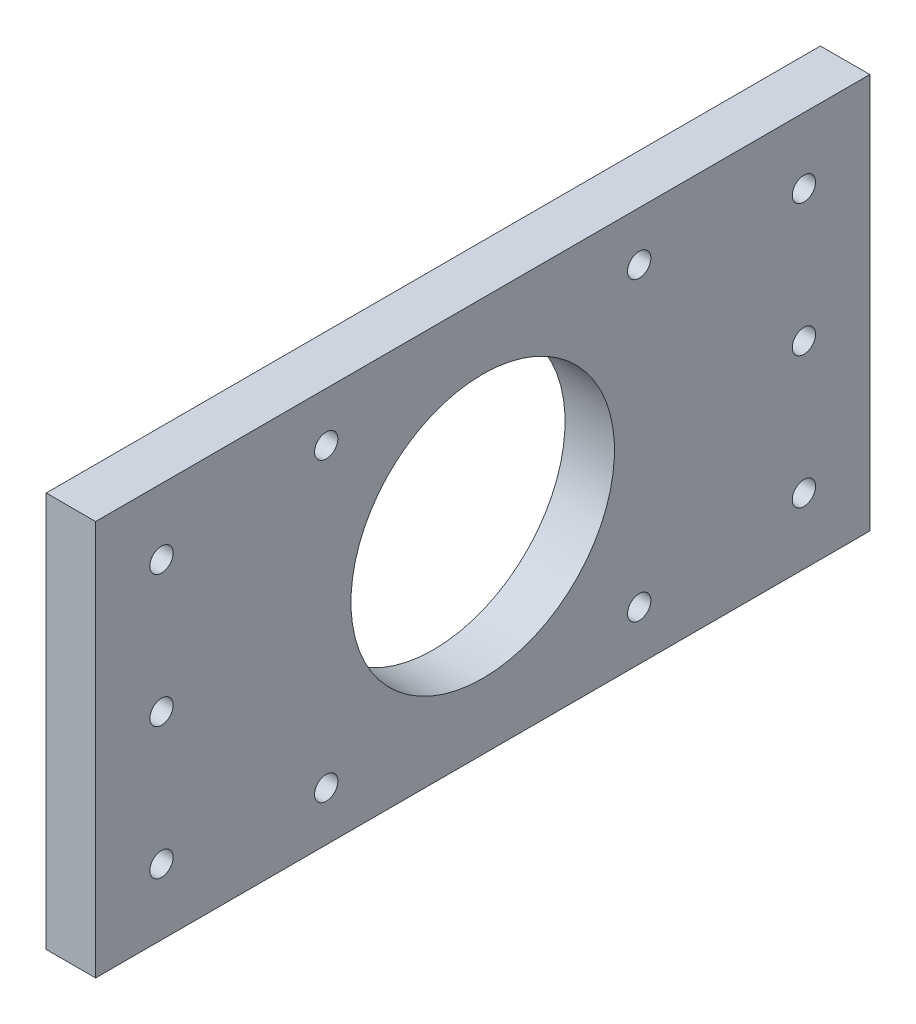
ISO-10303-21;
HEADER;
FILE_DESCRIPTION(('STEP AP214'),'2;1');
FILE_NAME('part.step','',(''),(''),'','','');
FILE_SCHEMA(('AUTOMOTIVE_DESIGN { 1 0 10303 214 1 1 1 1 }'));
ENDSEC;
DATA;
#1=APPLICATION_CONTEXT('core data for automotive mechanical design processes');
#2=APPLICATION_PROTOCOL_DEFINITION('international standard','automotive_design',2000,#1);
#3=PRODUCT_CONTEXT('',#1,'mechanical');
#4=PRODUCT('Part','Part','',(#3));
#5=PRODUCT_RELATED_PRODUCT_CATEGORY('part','',(#4));
#6=PRODUCT_DEFINITION_FORMATION('','',#4);
#7=PRODUCT_DEFINITION_CONTEXT('part definition',#1,'design');
#8=PRODUCT_DEFINITION('design','',#6,#7);
#9=PRODUCT_DEFINITION_SHAPE('','',#8);
#10=(LENGTH_UNIT() NAMED_UNIT(*) SI_UNIT(.MILLI.,.METRE.));
#11=(NAMED_UNIT(*) PLANE_ANGLE_UNIT() SI_UNIT($,.RADIAN.));
#12=(NAMED_UNIT(*) SI_UNIT($,.STERADIAN.) SOLID_ANGLE_UNIT());
#13=UNCERTAINTY_MEASURE_WITH_UNIT(LENGTH_MEASURE(1.E-05),#10,'distance_accuracy_value','');
#14=(GEOMETRIC_REPRESENTATION_CONTEXT(3) GLOBAL_UNCERTAINTY_ASSIGNED_CONTEXT((#13)) GLOBAL_UNIT_ASSIGNED_CONTEXT((#10,
#11,#12)) REPRESENTATION_CONTEXT('',''));
#15=CARTESIAN_POINT('',(0.,0.,0.));
#16=DIRECTION('',(0.,0.,1.));
#17=DIRECTION('',(1.,0.,0.));
#18=AXIS2_PLACEMENT_3D('',#15,#16,#17);
#19=CARTESIAN_POINT('',(4.76249999999999,38.1,149.225));
#20=DIRECTION('',(-1.,0.,0.));
#21=DIRECTION('',(0.,-1.,0.));
#22=AXIS2_PLACEMENT_3D('',#19,#20,#21);
#23=PLANE('',#22);
#24=CARTESIAN_POINT('',(4.7625,0.,74.6125));
#25=DIRECTION('',(1.,0.,0.));
#26=DIRECTION('',(0.,1.,0.));
#27=AXIS2_PLACEMENT_3D('',#24,#25,#26);
#28=CIRCLE('',#27,25.4);
#29=CARTESIAN_POINT('',(4.7625,25.4,74.6125));
#30=VERTEX_POINT('',#29);
#31=EDGE_CURVE('E170',#30,#30,#28,.T.);
#32=ORIENTED_EDGE('',*,*,#31,.F.);
#33=EDGE_LOOP('',(#32));
#34=FACE_BOUND('',#33,.T.);
#35=CARTESIAN_POINT('',(4.7625,25.4,136.525));
#36=DIRECTION('',(1.,0.,0.));
#37=DIRECTION('',(0.,0.,-1.));
#38=AXIS2_PLACEMENT_3D('',#35,#36,#37);
#39=CIRCLE('',#38,2.24789999999999);
#40=CARTESIAN_POINT('',(4.7625,25.4,134.2771));
#41=VERTEX_POINT('',#40);
#42=EDGE_CURVE('E166',#41,#41,#39,.T.);
#43=ORIENTED_EDGE('',*,*,#42,.F.);
#44=EDGE_LOOP('',(#43));
#45=FACE_BOUND('',#44,.T.);
#46=CARTESIAN_POINT('',(4.7625,0.,136.525));
#47=DIRECTION('',(1.,0.,0.));
#48=DIRECTION('',(0.,0.,-1.));
#49=AXIS2_PLACEMENT_3D('',#46,#47,#48);
#50=CIRCLE('',#49,2.24789999999999);
#51=CARTESIAN_POINT('',(4.7625,0.,134.2771));
#52=VERTEX_POINT('',#51);
#53=EDGE_CURVE('E160',#52,#52,#50,.T.);
#54=ORIENTED_EDGE('',*,*,#53,.F.);
#55=EDGE_LOOP('',(#54));
#56=FACE_BOUND('',#55,.T.);
#57=CARTESIAN_POINT('',(4.7625,-25.4,136.525));
#58=DIRECTION('',(1.,0.,0.));
#59=DIRECTION('',(0.,0.,-1.));
#60=AXIS2_PLACEMENT_3D('',#57,#58,#59);
#61=CIRCLE('',#60,2.24789999999999);
#62=CARTESIAN_POINT('',(4.7625,-25.4,134.2771));
#63=VERTEX_POINT('',#62);
#64=EDGE_CURVE('E154',#63,#63,#61,.T.);
#65=ORIENTED_EDGE('',*,*,#64,.F.);
#66=EDGE_LOOP('',(#65));
#67=FACE_BOUND('',#66,.T.);
#68=CARTESIAN_POINT('',(4.7625,25.4,12.7));
#69=DIRECTION('',(1.,0.,0.));
#70=DIRECTION('',(0.,0.,-1.));
#71=AXIS2_PLACEMENT_3D('',#68,#69,#70);
#72=CIRCLE('',#71,2.24789999999999);
#73=CARTESIAN_POINT('',(4.7625,25.4,10.4521));
#74=VERTEX_POINT('',#73);
#75=EDGE_CURVE('E148',#74,#74,#72,.T.);
#76=ORIENTED_EDGE('',*,*,#75,.F.);
#77=EDGE_LOOP('',(#76));
#78=FACE_BOUND('',#77,.T.);
#79=CARTESIAN_POINT('',(4.7625,0.,12.7));
#80=DIRECTION('',(1.,0.,0.));
#81=DIRECTION('',(0.,0.,-1.));
#82=AXIS2_PLACEMENT_3D('',#79,#80,#81);
#83=CIRCLE('',#82,2.24789999999999);
#84=CARTESIAN_POINT('',(4.7625,0.,10.4521));
#85=VERTEX_POINT('',#84);
#86=EDGE_CURVE('E142',#85,#85,#83,.T.);
#87=ORIENTED_EDGE('',*,*,#86,.F.);
#88=EDGE_LOOP('',(#87));
#89=FACE_BOUND('',#88,.T.);
#90=CARTESIAN_POINT('',(4.7625,-25.4,12.7));
#91=DIRECTION('',(1.,0.,0.));
#92=DIRECTION('',(0.,0.,-1.));
#93=AXIS2_PLACEMENT_3D('',#90,#91,#92);
#94=CIRCLE('',#93,2.24789999999999);
#95=CARTESIAN_POINT('',(4.7625,-25.4,10.4521));
#96=VERTEX_POINT('',#95);
#97=EDGE_CURVE('E136',#96,#96,#94,.T.);
#98=ORIENTED_EDGE('',*,*,#97,.F.);
#99=EDGE_LOOP('',(#98));
#100=FACE_BOUND('',#99,.T.);
#101=CARTESIAN_POINT('',(4.7625,-28.575,44.45));
#102=DIRECTION('',(1.,0.,0.));
#103=DIRECTION('',(0.,0.,-1.));
#104=AXIS2_PLACEMENT_3D('',#101,#102,#103);
#105=CIRCLE('',#104,2.24789999999999);
#106=CARTESIAN_POINT('',(4.7625,-28.575,42.2021));
#107=VERTEX_POINT('',#106);
#108=EDGE_CURVE('E130',#107,#107,#105,.T.);
#109=ORIENTED_EDGE('',*,*,#108,.F.);
#110=EDGE_LOOP('',(#109));
#111=FACE_BOUND('',#110,.T.);
#112=CARTESIAN_POINT('',(4.7625,28.575,104.775));
#113=DIRECTION('',(1.,0.,0.));
#114=DIRECTION('',(0.,0.,-1.));
#115=AXIS2_PLACEMENT_3D('',#112,#113,#114);
#116=CIRCLE('',#115,2.24789999999999);
#117=CARTESIAN_POINT('',(4.7625,28.575,102.5271));
#118=VERTEX_POINT('',#117);
#119=EDGE_CURVE('E124',#118,#118,#116,.T.);
#120=ORIENTED_EDGE('',*,*,#119,.F.);
#121=EDGE_LOOP('',(#120));
#122=FACE_BOUND('',#121,.T.);
#123=CARTESIAN_POINT('',(4.7625,-28.575,104.775));
#124=DIRECTION('',(1.,0.,0.));
#125=DIRECTION('',(0.,0.,-1.));
#126=AXIS2_PLACEMENT_3D('',#123,#124,#125);
#127=CIRCLE('',#126,2.24789999999999);
#128=CARTESIAN_POINT('',(4.7625,-28.575,102.5271));
#129=VERTEX_POINT('',#128);
#130=EDGE_CURVE('E118',#129,#129,#127,.T.);
#131=ORIENTED_EDGE('',*,*,#130,.F.);
#132=EDGE_LOOP('',(#131));
#133=FACE_BOUND('',#132,.T.);
#134=CARTESIAN_POINT('',(4.7625,28.575,44.45));
#135=DIRECTION('',(1.,0.,0.));
#136=DIRECTION('',(0.,0.,-1.));
#137=AXIS2_PLACEMENT_3D('',#134,#135,#136);
#138=CIRCLE('',#137,2.24789999999999);
#139=CARTESIAN_POINT('',(4.7625,28.575,42.2021));
#140=VERTEX_POINT('',#139);
#141=EDGE_CURVE('E112',#140,#140,#138,.T.);
#142=ORIENTED_EDGE('',*,*,#141,.F.);
#143=EDGE_LOOP('',(#142));
#144=FACE_BOUND('',#143,.T.);
#145=DIRECTION('',(0.,1.,0.));
#146=VECTOR('',#145,1.);
#147=CARTESIAN_POINT('',(4.76249999999999,38.1,0.));
#148=LINE('',#147,#146);
#149=CARTESIAN_POINT('',(4.7625,-38.1,0.));
#150=VERTEX_POINT('',#149);
#151=CARTESIAN_POINT('',(4.76249999999999,38.1,0.));
#152=VERTEX_POINT('',#151);
#153=EDGE_CURVE('E96',#150,#152,#148,.T.);
#154=ORIENTED_EDGE('',*,*,#153,.T.);
#155=DIRECTION('',(0.,0.,-1.));
#156=VECTOR('',#155,1.);
#157=CARTESIAN_POINT('',(4.76249999999999,38.1,149.225));
#158=LINE('',#157,#156);
#159=CARTESIAN_POINT('',(4.76249999999999,38.1,149.225));
#160=VERTEX_POINT('',#159);
#161=EDGE_CURVE('E11',#160,#152,#158,.T.);
#162=ORIENTED_EDGE('',*,*,#161,.F.);
#163=DIRECTION('',(0.,1.,0.));
#164=VECTOR('',#163,1.);
#165=CARTESIAN_POINT('',(4.76249999999999,38.1,149.225));
#166=LINE('',#165,#164);
#167=CARTESIAN_POINT('',(4.7625,-38.1,149.225));
#168=VERTEX_POINT('',#167);
#169=EDGE_CURVE('E84',#168,#160,#166,.T.);
#170=ORIENTED_EDGE('',*,*,#169,.F.);
#171=DIRECTION('',(0.,0.,-1.));
#172=VECTOR('',#171,1.);
#173=CARTESIAN_POINT('',(4.7625,-38.1,149.225));
#174=LINE('',#173,#172);
#175=EDGE_CURVE('E92',#168,#150,#174,.T.);
#176=ORIENTED_EDGE('',*,*,#175,.T.);
#177=EDGE_LOOP('',(#154,#162,#170,#176));
#178=FACE_BOUND('',#177,.T.);
#179=ADVANCED_FACE('F33',(#34,#45,#56,#67,#78,#89,#100,#111,#122,#133,#144,#178),#23,.F.);
#180=CARTESIAN_POINT('',(-4.76250000000001,38.1,149.225));
#181=DIRECTION('',(0.,-1.,0.));
#182=DIRECTION('',(0.,0.,-1.));
#183=AXIS2_PLACEMENT_3D('',#180,#181,#182);
#184=PLANE('',#183);
#185=DIRECTION('',(-1.,0.,0.));
#186=VECTOR('',#185,1.);
#187=CARTESIAN_POINT('',(-4.76250000000001,38.1,0.));
#188=LINE('',#187,#186);
#189=CARTESIAN_POINT('',(-4.76250000000001,38.1,0.));
#190=VERTEX_POINT('',#189);
#191=EDGE_CURVE('E88',#152,#190,#188,.T.);
#192=ORIENTED_EDGE('',*,*,#191,.T.);
#193=DIRECTION('',(0.,0.,-1.));
#194=VECTOR('',#193,1.);
#195=CARTESIAN_POINT('',(-4.76250000000001,38.1,149.225));
#196=LINE('',#195,#194);
#197=CARTESIAN_POINT('',(-4.76250000000001,38.1,149.225));
#198=VERTEX_POINT('',#197);
#199=EDGE_CURVE('E41',#198,#190,#196,.T.);
#200=ORIENTED_EDGE('',*,*,#199,.F.);
#201=DIRECTION('',(-1.,0.,0.));
#202=VECTOR('',#201,1.);
#203=CARTESIAN_POINT('',(-4.76250000000001,38.1,149.225));
#204=LINE('',#203,#202);
#205=EDGE_CURVE('E79',#160,#198,#204,.T.);
#206=ORIENTED_EDGE('',*,*,#205,.F.);
#207=ORIENTED_EDGE('',*,*,#161,.T.);
#208=EDGE_LOOP('',(#192,#200,#206,#207));
#209=FACE_BOUND('',#208,.T.);
#210=ADVANCED_FACE('F87',(#209),#184,.F.);
#211=CARTESIAN_POINT('',(-4.76250000000001,38.1,149.225));
#212=DIRECTION('',(1.,0.,0.));
#213=DIRECTION('',(0.,1.,0.));
#214=AXIS2_PLACEMENT_3D('',#211,#212,#213);
#215=PLANE('',#214);
#216=CARTESIAN_POINT('',(-4.76250000000003,0.,74.6125));
#217=DIRECTION('',(1.,0.,0.));
#218=DIRECTION('',(0.,1.,0.));
#219=AXIS2_PLACEMENT_3D('',#216,#217,#218);
#220=CIRCLE('',#219,25.4);
#221=CARTESIAN_POINT('',(-4.76250000000003,25.4,74.6125));
#222=VERTEX_POINT('',#221);
#223=EDGE_CURVE('E169',#222,#222,#220,.T.);
#224=ORIENTED_EDGE('',*,*,#223,.T.);
#225=EDGE_LOOP('',(#224));
#226=FACE_BOUND('',#225,.T.);
#227=CARTESIAN_POINT('',(-4.76250000000002,25.4,136.525));
#228=DIRECTION('',(1.,0.,0.));
#229=DIRECTION('',(0.,0.,-1.));
#230=AXIS2_PLACEMENT_3D('',#227,#228,#229);
#231=CIRCLE('',#230,2.2479);
#232=CARTESIAN_POINT('',(-4.76250000000002,25.4,134.2771));
#233=VERTEX_POINT('',#232);
#234=EDGE_CURVE('E163',#233,#233,#231,.T.);
#235=ORIENTED_EDGE('',*,*,#234,.T.);
#236=EDGE_LOOP('',(#235));
#237=FACE_BOUND('',#236,.T.);
#238=CARTESIAN_POINT('',(-4.76250000000002,0.,136.525));
#239=DIRECTION('',(1.,0.,0.));
#240=DIRECTION('',(0.,0.,-1.));
#241=AXIS2_PLACEMENT_3D('',#238,#239,#240);
#242=CIRCLE('',#241,2.2479);
#243=CARTESIAN_POINT('',(-4.76250000000002,0.,134.2771));
#244=VERTEX_POINT('',#243);
#245=EDGE_CURVE('E157',#244,#244,#242,.T.);
#246=ORIENTED_EDGE('',*,*,#245,.T.);
#247=EDGE_LOOP('',(#246));
#248=FACE_BOUND('',#247,.T.);
#249=CARTESIAN_POINT('',(-4.76250000000002,-25.4,136.525));
#250=DIRECTION('',(1.,0.,0.));
#251=DIRECTION('',(0.,0.,-1.));
#252=AXIS2_PLACEMENT_3D('',#249,#250,#251);
#253=CIRCLE('',#252,2.2479);
#254=CARTESIAN_POINT('',(-4.76250000000002,-25.4,134.2771));
#255=VERTEX_POINT('',#254);
#256=EDGE_CURVE('E151',#255,#255,#253,.T.);
#257=ORIENTED_EDGE('',*,*,#256,.T.);
#258=EDGE_LOOP('',(#257));
#259=FACE_BOUND('',#258,.T.);
#260=CARTESIAN_POINT('',(-4.76250000000002,25.4,12.7));
#261=DIRECTION('',(1.,0.,0.));
#262=DIRECTION('',(0.,0.,-1.));
#263=AXIS2_PLACEMENT_3D('',#260,#261,#262);
#264=CIRCLE('',#263,2.2479);
#265=CARTESIAN_POINT('',(-4.76250000000002,25.4,10.4521));
#266=VERTEX_POINT('',#265);
#267=EDGE_CURVE('E145',#266,#266,#264,.T.);
#268=ORIENTED_EDGE('',*,*,#267,.T.);
#269=EDGE_LOOP('',(#268));
#270=FACE_BOUND('',#269,.T.);
#271=CARTESIAN_POINT('',(-4.76250000000002,0.,12.7));
#272=DIRECTION('',(1.,0.,0.));
#273=DIRECTION('',(0.,0.,-1.));
#274=AXIS2_PLACEMENT_3D('',#271,#272,#273);
#275=CIRCLE('',#274,2.2479);
#276=CARTESIAN_POINT('',(-4.76250000000002,0.,10.4521));
#277=VERTEX_POINT('',#276);
#278=EDGE_CURVE('E139',#277,#277,#275,.T.);
#279=ORIENTED_EDGE('',*,*,#278,.T.);
#280=EDGE_LOOP('',(#279));
#281=FACE_BOUND('',#280,.T.);
#282=CARTESIAN_POINT('',(-4.76250000000002,-25.4,12.7));
#283=DIRECTION('',(1.,0.,0.));
#284=DIRECTION('',(0.,0.,-1.));
#285=AXIS2_PLACEMENT_3D('',#282,#283,#284);
#286=CIRCLE('',#285,2.2479);
#287=CARTESIAN_POINT('',(-4.76250000000002,-25.4,10.4521));
#288=VERTEX_POINT('',#287);
#289=EDGE_CURVE('E133',#288,#288,#286,.T.);
#290=ORIENTED_EDGE('',*,*,#289,.T.);
#291=EDGE_LOOP('',(#290));
#292=FACE_BOUND('',#291,.T.);
#293=CARTESIAN_POINT('',(-4.76250000000001,-28.575,44.45));
#294=DIRECTION('',(1.,0.,0.));
#295=DIRECTION('',(0.,0.,-1.));
#296=AXIS2_PLACEMENT_3D('',#293,#294,#295);
#297=CIRCLE('',#296,2.2479);
#298=CARTESIAN_POINT('',(-4.76250000000001,-28.575,42.2021));
#299=VERTEX_POINT('',#298);
#300=EDGE_CURVE('E127',#299,#299,#297,.T.);
#301=ORIENTED_EDGE('',*,*,#300,.T.);
#302=EDGE_LOOP('',(#301));
#303=FACE_BOUND('',#302,.T.);
#304=CARTESIAN_POINT('',(-4.76250000000002,28.575,104.775));
#305=DIRECTION('',(1.,0.,0.));
#306=DIRECTION('',(0.,0.,-1.));
#307=AXIS2_PLACEMENT_3D('',#304,#305,#306);
#308=CIRCLE('',#307,2.2479);
#309=CARTESIAN_POINT('',(-4.76250000000002,28.575,102.5271));
#310=VERTEX_POINT('',#309);
#311=EDGE_CURVE('E121',#310,#310,#308,.T.);
#312=ORIENTED_EDGE('',*,*,#311,.T.);
#313=EDGE_LOOP('',(#312));
#314=FACE_BOUND('',#313,.T.);
#315=CARTESIAN_POINT('',(-4.76250000000001,-28.575,104.775));
#316=DIRECTION('',(1.,0.,0.));
#317=DIRECTION('',(0.,0.,-1.));
#318=AXIS2_PLACEMENT_3D('',#315,#316,#317);
#319=CIRCLE('',#318,2.2479);
#320=CARTESIAN_POINT('',(-4.76250000000001,-28.575,102.5271));
#321=VERTEX_POINT('',#320);
#322=EDGE_CURVE('E115',#321,#321,#319,.T.);
#323=ORIENTED_EDGE('',*,*,#322,.T.);
#324=EDGE_LOOP('',(#323));
#325=FACE_BOUND('',#324,.T.);
#326=CARTESIAN_POINT('',(-4.76250000000002,28.575,44.45));
#327=DIRECTION('',(1.,0.,0.));
#328=DIRECTION('',(0.,0.,-1.));
#329=AXIS2_PLACEMENT_3D('',#326,#327,#328);
#330=CIRCLE('',#329,2.2479);
#331=CARTESIAN_POINT('',(-4.76250000000002,28.575,42.2021));
#332=VERTEX_POINT('',#331);
#333=EDGE_CURVE('E99',#332,#332,#330,.T.);
#334=ORIENTED_EDGE('',*,*,#333,.T.);
#335=EDGE_LOOP('',(#334));
#336=FACE_BOUND('',#335,.T.);
#337=DIRECTION('',(0.,-1.,0.));
#338=VECTOR('',#337,1.);
#339=CARTESIAN_POINT('',(-4.76250000000001,38.1,0.));
#340=LINE('',#339,#338);
#341=CARTESIAN_POINT('',(-4.7625,-38.1,0.));
#342=VERTEX_POINT('',#341);
#343=EDGE_CURVE('E66',#190,#342,#340,.T.);
#344=ORIENTED_EDGE('',*,*,#343,.T.);
#345=DIRECTION('',(0.,0.,-1.));
#346=VECTOR('',#345,1.);
#347=CARTESIAN_POINT('',(-4.7625,-38.1,149.225));
#348=LINE('',#347,#346);
#349=CARTESIAN_POINT('',(-4.7625,-38.1,149.225));
#350=VERTEX_POINT('',#349);
#351=EDGE_CURVE('E89',#350,#342,#348,.T.);
#352=ORIENTED_EDGE('',*,*,#351,.F.);
#353=DIRECTION('',(0.,-1.,0.));
#354=VECTOR('',#353,1.);
#355=CARTESIAN_POINT('',(-4.76250000000001,38.1,149.225));
#356=LINE('',#355,#354);
#357=EDGE_CURVE('E82',#198,#350,#356,.T.);
#358=ORIENTED_EDGE('',*,*,#357,.F.);
#359=ORIENTED_EDGE('',*,*,#199,.T.);
#360=EDGE_LOOP('',(#344,#352,#358,#359));
#361=FACE_BOUND('',#360,.T.);
#362=ADVANCED_FACE('F90',(#226,#237,#248,#259,#270,#281,#292,#303,#314,#325,#336,#361),#215,.F.);
#363=CARTESIAN_POINT('',(-4.7625,-38.1,149.225));
#364=DIRECTION('',(0.,1.,0.));
#365=DIRECTION('',(0.,0.,1.));
#366=AXIS2_PLACEMENT_3D('',#363,#364,#365);
#367=PLANE('',#366);
#368=DIRECTION('',(1.,0.,0.));
#369=VECTOR('',#368,1.);
#370=CARTESIAN_POINT('',(-4.7625,-38.1,0.));
#371=LINE('',#370,#369);
#372=EDGE_CURVE('E72',#342,#150,#371,.T.);
#373=ORIENTED_EDGE('',*,*,#372,.T.);
#374=ORIENTED_EDGE('',*,*,#175,.F.);
#375=DIRECTION('',(1.,0.,0.));
#376=VECTOR('',#375,1.);
#377=CARTESIAN_POINT('',(-4.7625,-38.1,149.225));
#378=LINE('',#377,#376);
#379=EDGE_CURVE('E49',#350,#168,#378,.T.);
#380=ORIENTED_EDGE('',*,*,#379,.F.);
#381=ORIENTED_EDGE('',*,*,#351,.T.);
#382=EDGE_LOOP('',(#373,#374,#380,#381));
#383=FACE_BOUND('',#382,.T.);
#384=ADVANCED_FACE('F104',(#383),#367,.F.);
#385=CARTESIAN_POINT('',(0.,0.,149.225));
#386=DIRECTION('',(0.,0.,1.));
#387=DIRECTION('',(1.,0.,0.));
#388=AXIS2_PLACEMENT_3D('',#385,#386,#387);
#389=PLANE('',#388);
#390=ORIENTED_EDGE('',*,*,#169,.T.);
#391=ORIENTED_EDGE('',*,*,#205,.T.);
#392=ORIENTED_EDGE('',*,*,#357,.T.);
#393=ORIENTED_EDGE('',*,*,#379,.T.);
#394=EDGE_LOOP('',(#390,#391,#392,#393));
#395=FACE_BOUND('',#394,.T.);
#396=ADVANCED_FACE('F80',(#395),#389,.T.);
#397=CARTESIAN_POINT('',(0.,0.,0.));
#398=DIRECTION('',(0.,0.,1.));
#399=DIRECTION('',(1.,0.,0.));
#400=AXIS2_PLACEMENT_3D('',#397,#398,#399);
#401=PLANE('',#400);
#402=ORIENTED_EDGE('',*,*,#153,.F.);
#403=ORIENTED_EDGE('',*,*,#372,.F.);
#404=ORIENTED_EDGE('',*,*,#343,.F.);
#405=ORIENTED_EDGE('',*,*,#191,.F.);
#406=EDGE_LOOP('',(#402,#403,#404,#405));
#407=FACE_BOUND('',#406,.T.);
#408=ADVANCED_FACE('F107',(#407),#401,.F.);
#409=CARTESIAN_POINT('',(4.7625,28.575,44.45));
#410=DIRECTION('',(1.,0.,0.));
#411=DIRECTION('',(0.,0.,-1.));
#412=AXIS2_PLACEMENT_3D('',#409,#410,#411);
#413=CYLINDRICAL_SURFACE('',#412,2.24789999999999);
#414=ORIENTED_EDGE('',*,*,#333,.F.);
#415=EDGE_LOOP('',(#414));
#416=FACE_BOUND('',#415,.T.);
#417=ORIENTED_EDGE('',*,*,#141,.T.);
#418=EDGE_LOOP('',(#417));
#419=FACE_BOUND('',#418,.T.);
#420=ADVANCED_FACE('F207',(#416,#419),#413,.F.);
#421=CARTESIAN_POINT('',(4.7625,-28.575,104.775));
#422=DIRECTION('',(1.,0.,0.));
#423=DIRECTION('',(0.,0.,-1.));
#424=AXIS2_PLACEMENT_3D('',#421,#422,#423);
#425=CYLINDRICAL_SURFACE('',#424,2.24789999999999);
#426=ORIENTED_EDGE('',*,*,#322,.F.);
#427=EDGE_LOOP('',(#426));
#428=FACE_BOUND('',#427,.T.);
#429=ORIENTED_EDGE('',*,*,#130,.T.);
#430=EDGE_LOOP('',(#429));
#431=FACE_BOUND('',#430,.T.);
#432=ADVANCED_FACE('F209',(#428,#431),#425,.F.);
#433=CARTESIAN_POINT('',(4.7625,28.575,104.775));
#434=DIRECTION('',(1.,0.,0.));
#435=DIRECTION('',(0.,0.,-1.));
#436=AXIS2_PLACEMENT_3D('',#433,#434,#435);
#437=CYLINDRICAL_SURFACE('',#436,2.24789999999999);
#438=ORIENTED_EDGE('',*,*,#311,.F.);
#439=EDGE_LOOP('',(#438));
#440=FACE_BOUND('',#439,.T.);
#441=ORIENTED_EDGE('',*,*,#119,.T.);
#442=EDGE_LOOP('',(#441));
#443=FACE_BOUND('',#442,.T.);
#444=ADVANCED_FACE('F216',(#440,#443),#437,.F.);
#445=CARTESIAN_POINT('',(4.7625,-28.575,44.45));
#446=DIRECTION('',(1.,0.,0.));
#447=DIRECTION('',(0.,0.,-1.));
#448=AXIS2_PLACEMENT_3D('',#445,#446,#447);
#449=CYLINDRICAL_SURFACE('',#448,2.24789999999999);
#450=ORIENTED_EDGE('',*,*,#300,.F.);
#451=EDGE_LOOP('',(#450));
#452=FACE_BOUND('',#451,.T.);
#453=ORIENTED_EDGE('',*,*,#108,.T.);
#454=EDGE_LOOP('',(#453));
#455=FACE_BOUND('',#454,.T.);
#456=ADVANCED_FACE('F272',(#452,#455),#449,.F.);
#457=CARTESIAN_POINT('',(4.7625,-25.4,12.7));
#458=DIRECTION('',(1.,0.,0.));
#459=DIRECTION('',(0.,0.,-1.));
#460=AXIS2_PLACEMENT_3D('',#457,#458,#459);
#461=CYLINDRICAL_SURFACE('',#460,2.24789999999999);
#462=ORIENTED_EDGE('',*,*,#289,.F.);
#463=EDGE_LOOP('',(#462));
#464=FACE_BOUND('',#463,.T.);
#465=ORIENTED_EDGE('',*,*,#97,.T.);
#466=EDGE_LOOP('',(#465));
#467=FACE_BOUND('',#466,.T.);
#468=ADVANCED_FACE('F281',(#464,#467),#461,.F.);
#469=CARTESIAN_POINT('',(4.7625,0.,12.7));
#470=DIRECTION('',(1.,0.,0.));
#471=DIRECTION('',(0.,0.,-1.));
#472=AXIS2_PLACEMENT_3D('',#469,#470,#471);
#473=CYLINDRICAL_SURFACE('',#472,2.24789999999999);
#474=ORIENTED_EDGE('',*,*,#278,.F.);
#475=EDGE_LOOP('',(#474));
#476=FACE_BOUND('',#475,.T.);
#477=ORIENTED_EDGE('',*,*,#86,.T.);
#478=EDGE_LOOP('',(#477));
#479=FACE_BOUND('',#478,.T.);
#480=ADVANCED_FACE('F291',(#476,#479),#473,.F.);
#481=CARTESIAN_POINT('',(4.7625,25.4,12.7));
#482=DIRECTION('',(1.,0.,0.));
#483=DIRECTION('',(0.,0.,-1.));
#484=AXIS2_PLACEMENT_3D('',#481,#482,#483);
#485=CYLINDRICAL_SURFACE('',#484,2.24789999999999);
#486=ORIENTED_EDGE('',*,*,#267,.F.);
#487=EDGE_LOOP('',(#486));
#488=FACE_BOUND('',#487,.T.);
#489=ORIENTED_EDGE('',*,*,#75,.T.);
#490=EDGE_LOOP('',(#489));
#491=FACE_BOUND('',#490,.T.);
#492=ADVANCED_FACE('F301',(#488,#491),#485,.F.);
#493=CARTESIAN_POINT('',(4.7625,-25.4,136.525));
#494=DIRECTION('',(1.,0.,0.));
#495=DIRECTION('',(0.,0.,-1.));
#496=AXIS2_PLACEMENT_3D('',#493,#494,#495);
#497=CYLINDRICAL_SURFACE('',#496,2.24789999999999);
#498=ORIENTED_EDGE('',*,*,#256,.F.);
#499=EDGE_LOOP('',(#498));
#500=FACE_BOUND('',#499,.T.);
#501=ORIENTED_EDGE('',*,*,#64,.T.);
#502=EDGE_LOOP('',(#501));
#503=FACE_BOUND('',#502,.T.);
#504=ADVANCED_FACE('F311',(#500,#503),#497,.F.);
#505=CARTESIAN_POINT('',(4.7625,0.,136.525));
#506=DIRECTION('',(1.,0.,0.));
#507=DIRECTION('',(0.,0.,-1.));
#508=AXIS2_PLACEMENT_3D('',#505,#506,#507);
#509=CYLINDRICAL_SURFACE('',#508,2.24789999999999);
#510=ORIENTED_EDGE('',*,*,#245,.F.);
#511=EDGE_LOOP('',(#510));
#512=FACE_BOUND('',#511,.T.);
#513=ORIENTED_EDGE('',*,*,#53,.T.);
#514=EDGE_LOOP('',(#513));
#515=FACE_BOUND('',#514,.T.);
#516=ADVANCED_FACE('F321',(#512,#515),#509,.F.);
#517=CARTESIAN_POINT('',(4.7625,25.4,136.525));
#518=DIRECTION('',(1.,0.,0.));
#519=DIRECTION('',(0.,0.,-1.));
#520=AXIS2_PLACEMENT_3D('',#517,#518,#519);
#521=CYLINDRICAL_SURFACE('',#520,2.24789999999999);
#522=ORIENTED_EDGE('',*,*,#234,.F.);
#523=EDGE_LOOP('',(#522));
#524=FACE_BOUND('',#523,.T.);
#525=ORIENTED_EDGE('',*,*,#42,.T.);
#526=EDGE_LOOP('',(#525));
#527=FACE_BOUND('',#526,.T.);
#528=ADVANCED_FACE('F181',(#524,#527),#521,.F.);
#529=CARTESIAN_POINT('',(-4.76250000000003,0.,74.6125));
#530=DIRECTION('',(1.,0.,0.));
#531=DIRECTION('',(0.,1.,0.));
#532=AXIS2_PLACEMENT_3D('',#529,#530,#531);
#533=CYLINDRICAL_SURFACE('',#532,25.4);
#534=ORIENTED_EDGE('',*,*,#223,.F.);
#535=EDGE_LOOP('',(#534));
#536=FACE_BOUND('',#535,.T.);
#537=ORIENTED_EDGE('',*,*,#31,.T.);
#538=EDGE_LOOP('',(#537));
#539=FACE_BOUND('',#538,.T.);
#540=ADVANCED_FACE('F178',(#536,#539),#533,.F.);
#541=CLOSED_SHELL('',(#179,#210,#362,#384,#396,#408,#420,#432,#444,#456,#468,#480,#492,#504,
#516,#528,#540));
#542=MANIFOLD_SOLID_BREP('B2',#541);
#543=ADVANCED_BREP_SHAPE_REPRESENTATION('',(#18,#542),#14);
#544=SHAPE_DEFINITION_REPRESENTATION(#9,#543);
ENDSEC;
END-ISO-10303-21;
